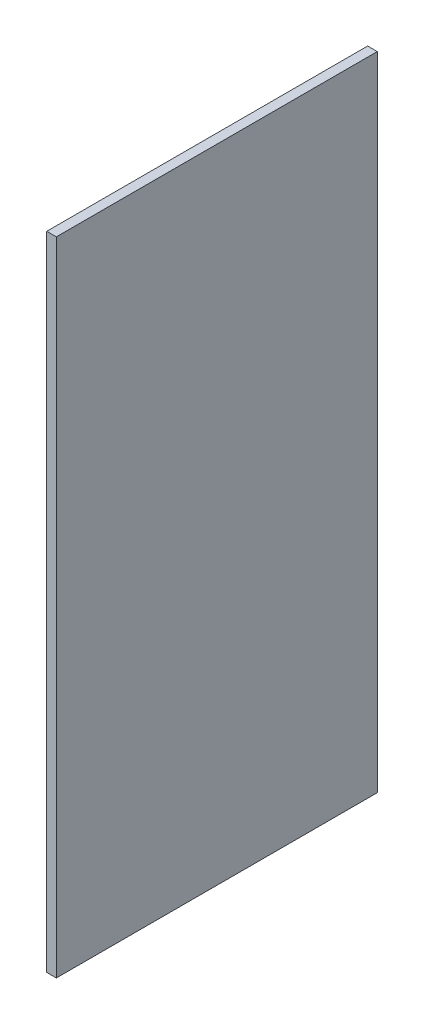
ISO-10303-21;
HEADER;
FILE_DESCRIPTION(('STEP AP214'),'2;1');
FILE_NAME('part.step','',(''),(''),'','','');
FILE_SCHEMA(('AUTOMOTIVE_DESIGN { 1 0 10303 214 1 1 1 1 }'));
ENDSEC;
DATA;
#1=APPLICATION_CONTEXT('core data for automotive mechanical design processes');
#2=APPLICATION_PROTOCOL_DEFINITION('international standard','automotive_design',2000,#1);
#3=PRODUCT_CONTEXT('',#1,'mechanical');
#4=PRODUCT('Part','Part','',(#3));
#5=PRODUCT_RELATED_PRODUCT_CATEGORY('part','',(#4));
#6=PRODUCT_DEFINITION_FORMATION('','',#4);
#7=PRODUCT_DEFINITION_CONTEXT('part definition',#1,'design');
#8=PRODUCT_DEFINITION('design','',#6,#7);
#9=PRODUCT_DEFINITION_SHAPE('','',#8);
#10=(LENGTH_UNIT() NAMED_UNIT(*) SI_UNIT(.MILLI.,.METRE.));
#11=(NAMED_UNIT(*) PLANE_ANGLE_UNIT() SI_UNIT($,.RADIAN.));
#12=(NAMED_UNIT(*) SI_UNIT($,.STERADIAN.) SOLID_ANGLE_UNIT());
#13=UNCERTAINTY_MEASURE_WITH_UNIT(LENGTH_MEASURE(1.E-05),#10,'distance_accuracy_value','');
#14=(GEOMETRIC_REPRESENTATION_CONTEXT(3) GLOBAL_UNCERTAINTY_ASSIGNED_CONTEXT((#13)) GLOBAL_UNIT_ASSIGNED_CONTEXT((#10,
#11,#12)) REPRESENTATION_CONTEXT('',''));
#15=CARTESIAN_POINT('',(0.,0.,0.));
#16=DIRECTION('',(0.,0.,1.));
#17=DIRECTION('',(1.,0.,0.));
#18=AXIS2_PLACEMENT_3D('',#15,#16,#17);
#19=CARTESIAN_POINT('',(145.5,0.,50.));
#20=DIRECTION('',(0.,1.,0.));
#21=DIRECTION('',(1.,0.,0.));
#22=AXIS2_PLACEMENT_3D('',#19,#20,#21);
#23=PLANE('',#22);
#24=DIRECTION('',(-1.,0.,0.));
#25=VECTOR('',#24,1.);
#26=CARTESIAN_POINT('',(100.,0.,0.));
#27=LINE('',#26,#25);
#28=CARTESIAN_POINT('',(100.,0.,0.));
#29=VERTEX_POINT('',#28);
#30=CARTESIAN_POINT('',(97.,0.,0.));
#31=VERTEX_POINT('',#30);
#32=EDGE_CURVE('E27',#29,#31,#27,.T.);
#33=ORIENTED_EDGE('',*,*,#32,.F.);
#34=DIRECTION('',(0.,0.,-1.));
#35=VECTOR('',#34,1.);
#36=CARTESIAN_POINT('',(100.,0.,100.));
#37=LINE('',#36,#35);
#38=CARTESIAN_POINT('',(100.,0.,100.));
#39=VERTEX_POINT('',#38);
#40=EDGE_CURVE('E20',#39,#29,#37,.T.);
#41=ORIENTED_EDGE('',*,*,#40,.F.);
#42=DIRECTION('',(1.,0.,0.));
#43=VECTOR('',#42,1.);
#44=CARTESIAN_POINT('',(97.,0.,100.));
#45=LINE('',#44,#43);
#46=CARTESIAN_POINT('',(97.,0.,100.));
#47=VERTEX_POINT('',#46);
#48=EDGE_CURVE('E88',#47,#39,#45,.T.);
#49=ORIENTED_EDGE('',*,*,#48,.F.);
#50=DIRECTION('',(0.,0.,1.));
#51=VECTOR('',#50,1.);
#52=CARTESIAN_POINT('',(97.,0.,0.));
#53=LINE('',#52,#51);
#54=EDGE_CURVE('E73',#31,#47,#53,.T.);
#55=ORIENTED_EDGE('',*,*,#54,.F.);
#56=EDGE_LOOP('',(#33,#41,#49,#55));
#57=FACE_BOUND('',#56,.T.);
#58=ADVANCED_FACE('F17',(#57),#23,.F.);
#59=CARTESIAN_POINT('',(145.5,200.,50.));
#60=DIRECTION('',(0.,1.,0.));
#61=DIRECTION('',(1.,0.,0.));
#62=AXIS2_PLACEMENT_3D('',#59,#60,#61);
#63=PLANE('',#62);
#64=DIRECTION('',(-1.,0.,0.));
#65=VECTOR('',#64,1.);
#66=CARTESIAN_POINT('',(100.,200.,0.));
#67=LINE('',#66,#65);
#68=CARTESIAN_POINT('',(100.,200.,0.));
#69=VERTEX_POINT('',#68);
#70=CARTESIAN_POINT('',(97.,200.,0.));
#71=VERTEX_POINT('',#70);
#72=EDGE_CURVE('E11',#69,#71,#67,.T.);
#73=ORIENTED_EDGE('',*,*,#72,.T.);
#74=DIRECTION('',(0.,0.,1.));
#75=VECTOR('',#74,1.);
#76=CARTESIAN_POINT('',(97.,200.,0.));
#77=LINE('',#76,#75);
#78=CARTESIAN_POINT('',(97.,200.,100.));
#79=VERTEX_POINT('',#78);
#80=EDGE_CURVE('E63',#71,#79,#77,.T.);
#81=ORIENTED_EDGE('',*,*,#80,.T.);
#82=DIRECTION('',(1.,0.,0.));
#83=VECTOR('',#82,1.);
#84=CARTESIAN_POINT('',(97.,200.,100.));
#85=LINE('',#84,#83);
#86=CARTESIAN_POINT('',(100.,200.,100.));
#87=VERTEX_POINT('',#86);
#88=EDGE_CURVE('E67',#79,#87,#85,.T.);
#89=ORIENTED_EDGE('',*,*,#88,.T.);
#90=DIRECTION('',(0.,0.,-1.));
#91=VECTOR('',#90,1.);
#92=CARTESIAN_POINT('',(100.,200.,100.));
#93=LINE('',#92,#91);
#94=EDGE_CURVE('E98',#87,#69,#93,.T.);
#95=ORIENTED_EDGE('',*,*,#94,.T.);
#96=EDGE_LOOP('',(#73,#81,#89,#95));
#97=FACE_BOUND('',#96,.T.);
#98=ADVANCED_FACE('F65',(#97),#63,.T.);
#99=CARTESIAN_POINT('',(100.,0.,0.));
#100=DIRECTION('',(0.,0.,-1.));
#101=DIRECTION('',(0.,-1.,0.));
#102=AXIS2_PLACEMENT_3D('',#99,#100,#101);
#103=PLANE('',#102);
#104=ORIENTED_EDGE('',*,*,#32,.T.);
#105=DIRECTION('',(0.,1.,0.));
#106=VECTOR('',#105,1.);
#107=CARTESIAN_POINT('',(97.,0.,0.));
#108=LINE('',#107,#106);
#109=EDGE_CURVE('E72',#31,#71,#108,.T.);
#110=ORIENTED_EDGE('',*,*,#109,.T.);
#111=ORIENTED_EDGE('',*,*,#72,.F.);
#112=DIRECTION('',(0.,1.,0.));
#113=VECTOR('',#112,1.);
#114=CARTESIAN_POINT('',(100.,0.,0.));
#115=LINE('',#114,#113);
#116=EDGE_CURVE('E101',#29,#69,#115,.T.);
#117=ORIENTED_EDGE('',*,*,#116,.F.);
#118=EDGE_LOOP('',(#104,#110,#111,#117));
#119=FACE_BOUND('',#118,.T.);
#120=ADVANCED_FACE('F153',(#119),#103,.T.);
#121=CARTESIAN_POINT('',(97.,0.,0.));
#122=DIRECTION('',(-1.,0.,0.));
#123=DIRECTION('',(0.,0.,1.));
#124=AXIS2_PLACEMENT_3D('',#121,#122,#123);
#125=PLANE('',#124);
#126=ORIENTED_EDGE('',*,*,#54,.T.);
#127=DIRECTION('',(0.,1.,0.));
#128=VECTOR('',#127,1.);
#129=CARTESIAN_POINT('',(97.,0.,100.));
#130=LINE('',#129,#128);
#131=EDGE_CURVE('E76',#47,#79,#130,.T.);
#132=ORIENTED_EDGE('',*,*,#131,.T.);
#133=ORIENTED_EDGE('',*,*,#80,.F.);
#134=ORIENTED_EDGE('',*,*,#109,.F.);
#135=EDGE_LOOP('',(#126,#132,#133,#134));
#136=FACE_BOUND('',#135,.T.);
#137=ADVANCED_FACE('F77',(#136),#125,.T.);
#138=CARTESIAN_POINT('',(97.,0.,100.));
#139=DIRECTION('',(0.,0.,1.));
#140=DIRECTION('',(1.,0.,0.));
#141=AXIS2_PLACEMENT_3D('',#138,#139,#140);
#142=PLANE('',#141);
#143=ORIENTED_EDGE('',*,*,#48,.T.);
#144=DIRECTION('',(0.,1.,0.));
#145=VECTOR('',#144,1.);
#146=CARTESIAN_POINT('',(100.,0.,100.));
#147=LINE('',#146,#145);
#148=EDGE_CURVE('E85',#39,#87,#147,.T.);
#149=ORIENTED_EDGE('',*,*,#148,.T.);
#150=ORIENTED_EDGE('',*,*,#88,.F.);
#151=ORIENTED_EDGE('',*,*,#131,.F.);
#152=EDGE_LOOP('',(#143,#149,#150,#151));
#153=FACE_BOUND('',#152,.T.);
#154=ADVANCED_FACE('F83',(#153),#142,.T.);
#155=CARTESIAN_POINT('',(100.,0.,100.));
#156=DIRECTION('',(1.,0.,0.));
#157=DIRECTION('',(0.,0.,-1.));
#158=AXIS2_PLACEMENT_3D('',#155,#156,#157);
#159=PLANE('',#158);
#160=ORIENTED_EDGE('',*,*,#40,.T.);
#161=ORIENTED_EDGE('',*,*,#116,.T.);
#162=ORIENTED_EDGE('',*,*,#94,.F.);
#163=ORIENTED_EDGE('',*,*,#148,.F.);
#164=EDGE_LOOP('',(#160,#161,#162,#163));
#165=FACE_BOUND('',#164,.T.);
#166=ADVANCED_FACE('F133',(#165),#159,.T.);
#167=CLOSED_SHELL('',(#58,#98,#120,#137,#154,#166));
#168=MANIFOLD_SOLID_BREP('B1',#167);
#169=ADVANCED_BREP_SHAPE_REPRESENTATION('',(#18,#168),#14);
#170=SHAPE_DEFINITION_REPRESENTATION(#9,#169);
ENDSEC;
END-ISO-10303-21;
